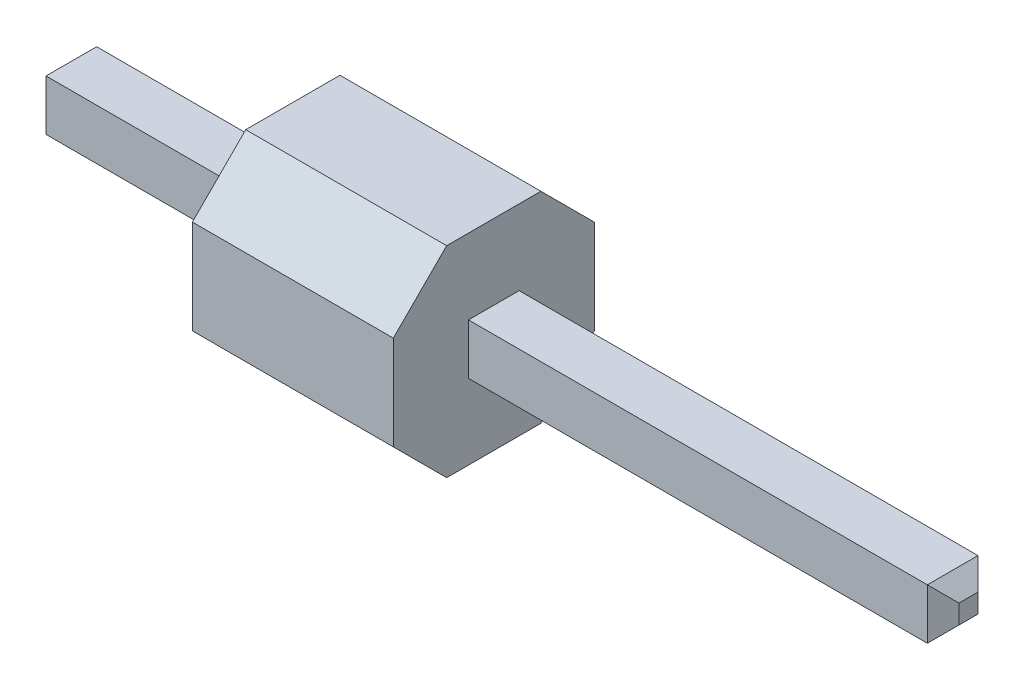
ISO-10303-21;
HEADER;
FILE_DESCRIPTION(('STEP AP214'),'2;1');
FILE_NAME('part.step','',(''),(''),'','','');
FILE_SCHEMA(('AUTOMOTIVE_DESIGN { 1 0 10303 214 1 1 1 1 }'));
ENDSEC;
DATA;
#1=APPLICATION_CONTEXT('core data for automotive mechanical design processes');
#2=APPLICATION_PROTOCOL_DEFINITION('international standard','automotive_design',2000,#1);
#3=PRODUCT_CONTEXT('',#1,'mechanical');
#4=PRODUCT('Part','Part','',(#3));
#5=PRODUCT_RELATED_PRODUCT_CATEGORY('part','',(#4));
#6=PRODUCT_DEFINITION_FORMATION('','',#4);
#7=PRODUCT_DEFINITION_CONTEXT('part definition',#1,'design');
#8=PRODUCT_DEFINITION('design','',#6,#7);
#9=PRODUCT_DEFINITION_SHAPE('','',#8);
#10=(LENGTH_UNIT() NAMED_UNIT(*) SI_UNIT(.MILLI.,.METRE.));
#11=(NAMED_UNIT(*) PLANE_ANGLE_UNIT() SI_UNIT($,.RADIAN.));
#12=(NAMED_UNIT(*) SI_UNIT($,.STERADIAN.) SOLID_ANGLE_UNIT());
#13=UNCERTAINTY_MEASURE_WITH_UNIT(LENGTH_MEASURE(1.E-05),#10,'distance_accuracy_value','');
#14=(GEOMETRIC_REPRESENTATION_CONTEXT(3) GLOBAL_UNCERTAINTY_ASSIGNED_CONTEXT((#13)) GLOBAL_UNIT_ASSIGNED_CONTEXT((#10,
#11,#12)) REPRESENTATION_CONTEXT('',''));
#15=CARTESIAN_POINT('',(0.,0.,0.));
#16=DIRECTION('',(0.,0.,1.));
#17=DIRECTION('',(1.,0.,0.));
#18=AXIS2_PLACEMENT_3D('',#15,#16,#17);
#19=CARTESIAN_POINT('',(-3.,-0.320000000000004,0.32));
#20=DIRECTION('',(0.,0.,1.));
#21=DIRECTION('',(1.,0.,0.));
#22=AXIS2_PLACEMENT_3D('',#19,#20,#21);
#23=PLANE('',#22);
#24=DIRECTION('',(1.,0.,0.));
#25=VECTOR('',#24,1.);
#26=CARTESIAN_POINT('',(-3.,0.319999999999996,0.32));
#27=LINE('',#26,#25);
#28=CARTESIAN_POINT('',(-2.8,0.319999999999996,0.32));
#29=VERTEX_POINT('',#28);
#30=CARTESIAN_POINT('',(8.34,0.319999999999996,0.32));
#31=VERTEX_POINT('',#30);
#32=EDGE_CURVE('E150',#29,#31,#27,.T.);
#33=ORIENTED_EDGE('',*,*,#32,.F.);
#34=DIRECTION('',(0.,-1.,0.));
#35=VECTOR('',#34,1.);
#36=CARTESIAN_POINT('',(-2.8,-0.320000000000004,0.32));
#37=LINE('',#36,#35);
#38=CARTESIAN_POINT('',(-2.8,-0.320000000000004,0.32));
#39=VERTEX_POINT('',#38);
#40=EDGE_CURVE('E170',#29,#39,#37,.T.);
#41=ORIENTED_EDGE('',*,*,#40,.T.);
#42=DIRECTION('',(1.,0.,0.));
#43=VECTOR('',#42,1.);
#44=CARTESIAN_POINT('',(-3.,-0.320000000000004,0.32));
#45=LINE('',#44,#43);
#46=CARTESIAN_POINT('',(8.34,-0.320000000000004,0.32));
#47=VERTEX_POINT('',#46);
#48=EDGE_CURVE('E141',#39,#47,#45,.T.);
#49=ORIENTED_EDGE('',*,*,#48,.T.);
#50=DIRECTION('',(0.,1.,0.));
#51=VECTOR('',#50,1.);
#52=CARTESIAN_POINT('',(8.34,0.319999999999996,0.32));
#53=LINE('',#52,#51);
#54=EDGE_CURVE('E168',#47,#31,#53,.T.);
#55=ORIENTED_EDGE('',*,*,#54,.T.);
#56=EDGE_LOOP('',(#33,#41,#49,#55));
#57=FACE_BOUND('',#56,.T.);
#58=ADVANCED_FACE('F45',(#57),#23,.T.);
#59=CARTESIAN_POINT('',(-3.,0.319999999999996,0.32));
#60=DIRECTION('',(0.,1.,0.));
#61=DIRECTION('',(0.,0.,1.));
#62=AXIS2_PLACEMENT_3D('',#59,#60,#61);
#63=PLANE('',#62);
#64=DIRECTION('',(1.,0.,0.));
#65=VECTOR('',#64,1.);
#66=CARTESIAN_POINT('',(-3.,0.319999999999996,-0.32));
#67=LINE('',#66,#65);
#68=CARTESIAN_POINT('',(-2.8,0.319999999999996,-0.32));
#69=VERTEX_POINT('',#68);
#70=CARTESIAN_POINT('',(8.34,0.319999999999996,-0.32));
#71=VERTEX_POINT('',#70);
#72=EDGE_CURVE('E148',#69,#71,#67,.T.);
#73=ORIENTED_EDGE('',*,*,#72,.F.);
#74=DIRECTION('',(0.,0.,1.));
#75=VECTOR('',#74,1.);
#76=CARTESIAN_POINT('',(-2.8,0.319999999999996,0.32));
#77=LINE('',#76,#75);
#78=EDGE_CURVE('E166',#69,#29,#77,.T.);
#79=ORIENTED_EDGE('',*,*,#78,.T.);
#80=ORIENTED_EDGE('',*,*,#32,.T.);
#81=DIRECTION('',(0.,0.,-1.));
#82=VECTOR('',#81,1.);
#83=CARTESIAN_POINT('',(8.34,0.319999999999996,-0.32));
#84=LINE('',#83,#82);
#85=EDGE_CURVE('E131',#31,#71,#84,.T.);
#86=ORIENTED_EDGE('',*,*,#85,.T.);
#87=EDGE_LOOP('',(#73,#79,#80,#86));
#88=FACE_BOUND('',#87,.T.);
#89=ADVANCED_FACE('F208',(#88),#63,.T.);
#90=CARTESIAN_POINT('',(-3.,-0.320000000000004,-0.32));
#91=DIRECTION('',(0.,0.,-1.));
#92=DIRECTION('',(-1.,0.,0.));
#93=AXIS2_PLACEMENT_3D('',#90,#91,#92);
#94=PLANE('',#93);
#95=DIRECTION('',(1.,0.,0.));
#96=VECTOR('',#95,1.);
#97=CARTESIAN_POINT('',(-3.,-0.320000000000004,-0.32));
#98=LINE('',#97,#96);
#99=CARTESIAN_POINT('',(-2.8,-0.320000000000004,-0.32));
#100=VERTEX_POINT('',#99);
#101=CARTESIAN_POINT('',(8.34,-0.320000000000004,-0.32));
#102=VERTEX_POINT('',#101);
#103=EDGE_CURVE('E138',#100,#102,#98,.T.);
#104=ORIENTED_EDGE('',*,*,#103,.F.);
#105=DIRECTION('',(0.,1.,0.));
#106=VECTOR('',#105,1.);
#107=CARTESIAN_POINT('',(-2.8,-0.320000000000004,-0.32));
#108=LINE('',#107,#106);
#109=EDGE_CURVE('E123',#100,#69,#108,.T.);
#110=ORIENTED_EDGE('',*,*,#109,.T.);
#111=ORIENTED_EDGE('',*,*,#72,.T.);
#112=DIRECTION('',(0.,-1.,0.));
#113=VECTOR('',#112,1.);
#114=CARTESIAN_POINT('',(8.34,-0.320000000000004,-0.32));
#115=LINE('',#114,#113);
#116=EDGE_CURVE('E132',#71,#102,#115,.T.);
#117=ORIENTED_EDGE('',*,*,#116,.T.);
#118=EDGE_LOOP('',(#104,#110,#111,#117));
#119=FACE_BOUND('',#118,.T.);
#120=ADVANCED_FACE('F146',(#119),#94,.T.);
#121=CARTESIAN_POINT('',(-3.,-0.320000000000004,0.32));
#122=DIRECTION('',(0.,-1.,0.));
#123=DIRECTION('',(0.,0.,-1.));
#124=AXIS2_PLACEMENT_3D('',#121,#122,#123);
#125=PLANE('',#124);
#126=ORIENTED_EDGE('',*,*,#48,.F.);
#127=DIRECTION('',(0.,0.,-1.));
#128=VECTOR('',#127,1.);
#129=CARTESIAN_POINT('',(-2.8,-0.320000000000004,0.32));
#130=LINE('',#129,#128);
#131=EDGE_CURVE('E115',#39,#100,#130,.T.);
#132=ORIENTED_EDGE('',*,*,#131,.T.);
#133=ORIENTED_EDGE('',*,*,#103,.T.);
#134=DIRECTION('',(0.,0.,1.));
#135=VECTOR('',#134,1.);
#136=CARTESIAN_POINT('',(8.34,-0.320000000000004,0.32));
#137=LINE('',#136,#135);
#138=EDGE_CURVE('E144',#102,#47,#137,.T.);
#139=ORIENTED_EDGE('',*,*,#138,.T.);
#140=EDGE_LOOP('',(#126,#132,#133,#139));
#141=FACE_BOUND('',#140,.T.);
#142=ADVANCED_FACE('F137',(#141),#125,.T.);
#143=CARTESIAN_POINT('',(-3.,0.,0.));
#144=DIRECTION('',(-1.,0.,0.));
#145=DIRECTION('',(0.,0.,1.));
#146=AXIS2_PLACEMENT_3D('',#143,#144,#145);
#147=PLANE('',#146);
#148=DIRECTION('',(0.,-1.,0.));
#149=VECTOR('',#148,1.);
#150=CARTESIAN_POINT('',(-3.,0.,-0.120000000000001));
#151=LINE('',#150,#149);
#152=CARTESIAN_POINT('',(-3.,0.119999999999997,-0.120000000000001));
#153=VERTEX_POINT('',#152);
#154=CARTESIAN_POINT('',(-3.,-0.120000000000006,-0.120000000000001));
#155=VERTEX_POINT('',#154);
#156=EDGE_CURVE('E160',#153,#155,#151,.T.);
#157=ORIENTED_EDGE('',*,*,#156,.T.);
#158=DIRECTION('',(0.,0.,1.));
#159=VECTOR('',#158,1.);
#160=CARTESIAN_POINT('',(-3.,-0.120000000000006,0.));
#161=LINE('',#160,#159);
#162=CARTESIAN_POINT('',(-3.,-0.120000000000006,0.120000000000001));
#163=VERTEX_POINT('',#162);
#164=EDGE_CURVE('E117',#155,#163,#161,.T.);
#165=ORIENTED_EDGE('',*,*,#164,.T.);
#166=DIRECTION('',(0.,1.,0.));
#167=VECTOR('',#166,1.);
#168=CARTESIAN_POINT('',(-3.,0.,0.120000000000001));
#169=LINE('',#168,#167);
#170=CARTESIAN_POINT('',(-3.,0.119999999999997,0.120000000000001));
#171=VERTEX_POINT('',#170);
#172=EDGE_CURVE('E143',#163,#171,#169,.T.);
#173=ORIENTED_EDGE('',*,*,#172,.T.);
#174=DIRECTION('',(0.,0.,-1.));
#175=VECTOR('',#174,1.);
#176=CARTESIAN_POINT('',(-3.,0.119999999999997,0.));
#177=LINE('',#176,#175);
#178=EDGE_CURVE('E158',#171,#153,#177,.T.);
#179=ORIENTED_EDGE('',*,*,#178,.T.);
#180=EDGE_LOOP('',(#157,#165,#173,#179));
#181=FACE_BOUND('',#180,.T.);
#182=ADVANCED_FACE('F203',(#181),#147,.T.);
#183=CARTESIAN_POINT('',(8.54,0.,0.));
#184=DIRECTION('',(-1.,0.,0.));
#185=DIRECTION('',(0.,0.,1.));
#186=AXIS2_PLACEMENT_3D('',#183,#184,#185);
#187=PLANE('',#186);
#188=DIRECTION('',(0.,1.,0.));
#189=VECTOR('',#188,1.);
#190=CARTESIAN_POINT('',(8.54,0.319999999999996,-0.120000000000001));
#191=LINE('',#190,#189);
#192=CARTESIAN_POINT('',(8.54,-0.120000000000006,-0.120000000000001));
#193=VERTEX_POINT('',#192);
#194=CARTESIAN_POINT('',(8.54,0.119999999999997,-0.120000000000001));
#195=VERTEX_POINT('',#194);
#196=EDGE_CURVE('E54',#193,#195,#191,.T.);
#197=ORIENTED_EDGE('',*,*,#196,.T.);
#198=DIRECTION('',(0.,0.,1.));
#199=VECTOR('',#198,1.);
#200=CARTESIAN_POINT('',(8.54,0.119999999999997,0.32));
#201=LINE('',#200,#199);
#202=CARTESIAN_POINT('',(8.54,0.119999999999997,0.120000000000001));
#203=VERTEX_POINT('',#202);
#204=EDGE_CURVE('E12',#195,#203,#201,.T.);
#205=ORIENTED_EDGE('',*,*,#204,.T.);
#206=DIRECTION('',(0.,-1.,0.));
#207=VECTOR('',#206,1.);
#208=CARTESIAN_POINT('',(8.54,-0.320000000000004,0.120000000000001));
#209=LINE('',#208,#207);
#210=CARTESIAN_POINT('',(8.54,-0.120000000000006,0.120000000000001));
#211=VERTEX_POINT('',#210);
#212=EDGE_CURVE('E172',#203,#211,#209,.T.);
#213=ORIENTED_EDGE('',*,*,#212,.T.);
#214=DIRECTION('',(0.,0.,-1.));
#215=VECTOR('',#214,1.);
#216=CARTESIAN_POINT('',(8.54,-0.120000000000006,-0.32));
#217=LINE('',#216,#215);
#218=EDGE_CURVE('E65',#211,#193,#217,.T.);
#219=ORIENTED_EDGE('',*,*,#218,.T.);
#220=EDGE_LOOP('',(#197,#205,#213,#219));
#221=FACE_BOUND('',#220,.T.);
#222=ADVANCED_FACE('F215',(#221),#187,.F.);
#223=CARTESIAN_POINT('',(-2.8,0.319999999999996,0.32));
#224=DIRECTION('',(0.707106781186551,-0.707106781186544,0.));
#225=DIRECTION('',(0.,0.,1.));
#226=AXIS2_PLACEMENT_3D('',#223,#224,#225);
#227=PLANE('',#226);
#228=DIRECTION('',(-0.577350269189622,-0.577350269189627,0.577350269189627));
#229=VECTOR('',#228,1.);
#230=CARTESIAN_POINT('',(-3.01333333333334,0.106666666666661,-0.106666666666665));
#231=LINE('',#230,#229);
#232=EDGE_CURVE('E126',#153,#69,#231,.F.);
#233=ORIENTED_EDGE('',*,*,#232,.F.);
#234=ORIENTED_EDGE('',*,*,#178,.F.);
#235=DIRECTION('',(-0.577350269189622,-0.577350269189627,-0.577350269189627));
#236=VECTOR('',#235,1.);
#237=CARTESIAN_POINT('',(-3.01333333333334,0.106666666666661,0.106666666666665));
#238=LINE('',#237,#236);
#239=EDGE_CURVE('E152',#29,#171,#238,.T.);
#240=ORIENTED_EDGE('',*,*,#239,.F.);
#241=ORIENTED_EDGE('',*,*,#78,.F.);
#242=EDGE_LOOP('',(#233,#234,#240,#241));
#243=FACE_BOUND('',#242,.T.);
#244=ADVANCED_FACE('F206',(#243),#227,.F.);
#245=CARTESIAN_POINT('',(-2.8,-0.320000000000004,0.32));
#246=DIRECTION('',(0.707106781186551,0.,-0.707106781186544));
#247=DIRECTION('',(0.,-1.,0.));
#248=AXIS2_PLACEMENT_3D('',#245,#246,#247);
#249=PLANE('',#248);
#250=ORIENTED_EDGE('',*,*,#239,.T.);
#251=ORIENTED_EDGE('',*,*,#172,.F.);
#252=DIRECTION('',(0.577350269189622,-0.577350269189627,0.577350269189627));
#253=VECTOR('',#252,1.);
#254=CARTESIAN_POINT('',(-2.8,-0.320000000000004,0.32));
#255=LINE('',#254,#253);
#256=EDGE_CURVE('E120',#39,#163,#255,.F.);
#257=ORIENTED_EDGE('',*,*,#256,.F.);
#258=ORIENTED_EDGE('',*,*,#40,.F.);
#259=EDGE_LOOP('',(#250,#251,#257,#258));
#260=FACE_BOUND('',#259,.T.);
#261=ADVANCED_FACE('F199',(#260),#249,.F.);
#262=CARTESIAN_POINT('',(-2.8,-0.320000000000004,-0.32));
#263=DIRECTION('',(0.707106781186551,0.,0.707106781186544));
#264=DIRECTION('',(0.,1.,0.));
#265=AXIS2_PLACEMENT_3D('',#262,#263,#264);
#266=PLANE('',#265);
#267=ORIENTED_EDGE('',*,*,#232,.T.);
#268=ORIENTED_EDGE('',*,*,#109,.F.);
#269=DIRECTION('',(-0.577350269189622,0.577350269189627,0.577350269189627));
#270=VECTOR('',#269,1.);
#271=CARTESIAN_POINT('',(-2.8,-0.320000000000004,-0.32));
#272=LINE('',#271,#270);
#273=EDGE_CURVE('E111',#155,#100,#272,.F.);
#274=ORIENTED_EDGE('',*,*,#273,.F.);
#275=ORIENTED_EDGE('',*,*,#156,.F.);
#276=EDGE_LOOP('',(#267,#268,#274,#275));
#277=FACE_BOUND('',#276,.T.);
#278=ADVANCED_FACE('F124',(#277),#266,.F.);
#279=CARTESIAN_POINT('',(-2.8,-0.320000000000004,0.32));
#280=DIRECTION('',(0.707106781186551,0.707106781186544,0.));
#281=DIRECTION('',(0.,0.,-1.));
#282=AXIS2_PLACEMENT_3D('',#279,#280,#281);
#283=PLANE('',#282);
#284=ORIENTED_EDGE('',*,*,#256,.T.);
#285=ORIENTED_EDGE('',*,*,#164,.F.);
#286=ORIENTED_EDGE('',*,*,#273,.T.);
#287=ORIENTED_EDGE('',*,*,#131,.F.);
#288=EDGE_LOOP('',(#284,#285,#286,#287));
#289=FACE_BOUND('',#288,.T.);
#290=ADVANCED_FACE('F113',(#289),#283,.F.);
#291=CARTESIAN_POINT('',(8.54,-0.120000000000006,0.));
#292=DIRECTION('',(0.707106781186548,-0.707106781186548,0.));
#293=DIRECTION('',(0.,0.,1.));
#294=AXIS2_PLACEMENT_3D('',#291,#292,#293);
#295=PLANE('',#294);
#296=DIRECTION('',(0.577350269189626,0.577350269189626,-0.577350269189626));
#297=VECTOR('',#296,1.);
#298=CARTESIAN_POINT('',(8.58,-0.0800000000000037,0.0799999999999993));
#299=LINE('',#298,#297);
#300=EDGE_CURVE('E183',#47,#211,#299,.T.);
#301=ORIENTED_EDGE('',*,*,#300,.F.);
#302=ORIENTED_EDGE('',*,*,#138,.F.);
#303=DIRECTION('',(0.577350269189626,0.577350269189626,0.577350269189626));
#304=VECTOR('',#303,1.);
#305=CARTESIAN_POINT('',(8.58,-0.0800000000000052,-0.0800000000000008));
#306=LINE('',#305,#304);
#307=EDGE_CURVE('E49',#193,#102,#306,.F.);
#308=ORIENTED_EDGE('',*,*,#307,.F.);
#309=ORIENTED_EDGE('',*,*,#218,.F.);
#310=EDGE_LOOP('',(#301,#302,#308,#309));
#311=FACE_BOUND('',#310,.T.);
#312=ADVANCED_FACE('F47',(#311),#295,.T.);
#313=CARTESIAN_POINT('',(8.54,0.,-0.120000000000001));
#314=DIRECTION('',(0.707106781186548,0.,-0.707106781186548));
#315=DIRECTION('',(0.,-1.,0.));
#316=AXIS2_PLACEMENT_3D('',#313,#314,#315);
#317=PLANE('',#316);
#318=ORIENTED_EDGE('',*,*,#307,.T.);
#319=ORIENTED_EDGE('',*,*,#116,.F.);
#320=DIRECTION('',(0.577350269189626,-0.577350269189626,0.577350269189626));
#321=VECTOR('',#320,1.);
#322=CARTESIAN_POINT('',(8.58,0.0799999999999979,-0.0800000000000023));
#323=LINE('',#322,#321);
#324=EDGE_CURVE('E182',#195,#71,#323,.F.);
#325=ORIENTED_EDGE('',*,*,#324,.F.);
#326=ORIENTED_EDGE('',*,*,#196,.F.);
#327=EDGE_LOOP('',(#318,#319,#325,#326));
#328=FACE_BOUND('',#327,.T.);
#329=ADVANCED_FACE('F191',(#328),#317,.T.);
#330=CARTESIAN_POINT('',(8.54,0.,0.120000000000001));
#331=DIRECTION('',(0.707106781186548,0.,0.707106781186548));
#332=DIRECTION('',(0.,1.,0.));
#333=AXIS2_PLACEMENT_3D('',#330,#331,#332);
#334=PLANE('',#333);
#335=ORIENTED_EDGE('',*,*,#300,.T.);
#336=ORIENTED_EDGE('',*,*,#212,.F.);
#337=DIRECTION('',(-0.577350269189626,0.577350269189626,0.577350269189626));
#338=VECTOR('',#337,1.);
#339=CARTESIAN_POINT('',(8.58,0.0799999999999979,0.0800000000000022));
#340=LINE('',#339,#338);
#341=EDGE_CURVE('E180',#31,#203,#340,.F.);
#342=ORIENTED_EDGE('',*,*,#341,.F.);
#343=ORIENTED_EDGE('',*,*,#54,.F.);
#344=EDGE_LOOP('',(#335,#336,#342,#343));
#345=FACE_BOUND('',#344,.T.);
#346=ADVANCED_FACE('F214',(#345),#334,.T.);
#347=CARTESIAN_POINT('',(8.54,0.119999999999997,0.));
#348=DIRECTION('',(0.707106781186548,0.707106781186548,0.));
#349=DIRECTION('',(0.,0.,-1.));
#350=AXIS2_PLACEMENT_3D('',#347,#348,#349);
#351=PLANE('',#350);
#352=ORIENTED_EDGE('',*,*,#324,.T.);
#353=ORIENTED_EDGE('',*,*,#85,.F.);
#354=ORIENTED_EDGE('',*,*,#341,.T.);
#355=ORIENTED_EDGE('',*,*,#204,.F.);
#356=EDGE_LOOP('',(#352,#353,#354,#355));
#357=FACE_BOUND('',#356,.T.);
#358=ADVANCED_FACE('F212',(#357),#351,.T.);
#359=CLOSED_SHELL('',(#58,#89,#120,#142,#182,#222,#244,#261,#278,#290,#312,#329,#346,#358));
#360=MANIFOLD_SOLID_BREP('B2',#359);
#361=CARTESIAN_POINT('',(2.54,0.,-1.27));
#362=DIRECTION('',(0.,0.,-1.));
#363=DIRECTION('',(-1.,0.,0.));
#364=AXIS2_PLACEMENT_3D('',#361,#362,#363);
#365=PLANE('',#364);
#366=DIRECTION('',(0.,-1.,0.));
#367=VECTOR('',#366,1.);
#368=CARTESIAN_POINT('',(0.,0.,-1.27));
#369=LINE('',#368,#367);
#370=CARTESIAN_POINT('',(0.,0.595482682999996,-1.27));
#371=VERTEX_POINT('',#370);
#372=CARTESIAN_POINT('',(0.,-0.595482683000005,-1.27));
#373=VERTEX_POINT('',#372);
#374=EDGE_CURVE('E464',#371,#373,#369,.T.);
#375=ORIENTED_EDGE('',*,*,#374,.F.);
#376=DIRECTION('',(-1.,0.,0.));
#377=VECTOR('',#376,1.);
#378=CARTESIAN_POINT('',(2.54,0.595482682999996,-1.27));
#379=LINE('',#378,#377);
#380=CARTESIAN_POINT('',(2.54,0.595482682999996,-1.27));
#381=VERTEX_POINT('',#380);
#382=EDGE_CURVE('E43',#381,#371,#379,.T.);
#383=ORIENTED_EDGE('',*,*,#382,.F.);
#384=DIRECTION('',(0.,-1.,0.));
#385=VECTOR('',#384,1.);
#386=CARTESIAN_POINT('',(2.54,0.,-1.27));
#387=LINE('',#386,#385);
#388=CARTESIAN_POINT('',(2.54,-0.595482683000005,-1.27));
#389=VERTEX_POINT('',#388);
#390=EDGE_CURVE('E521',#381,#389,#387,.T.);
#391=ORIENTED_EDGE('',*,*,#390,.T.);
#392=DIRECTION('',(-1.,0.,0.));
#393=VECTOR('',#392,1.);
#394=CARTESIAN_POINT('',(2.54,-0.595482683000005,-1.27));
#395=LINE('',#394,#393);
#396=EDGE_CURVE('E348',#389,#373,#395,.T.);
#397=ORIENTED_EDGE('',*,*,#396,.T.);
#398=EDGE_LOOP('',(#375,#383,#391,#397));
#399=FACE_BOUND('',#398,.T.);
#400=ADVANCED_FACE('F329',(#399),#365,.T.);
#401=CARTESIAN_POINT('',(2.54,0.932741341499998,-0.932741341499998));
#402=DIRECTION('',(0.,-0.707106781186548,0.707106781186547));
#403=DIRECTION('',(0.,-0.707106781186547,-0.707106781186548));
#404=AXIS2_PLACEMENT_3D('',#401,#402,#403);
#405=PLANE('',#404);
#406=DIRECTION('',(0.,0.707106781186547,0.707106781186548));
#407=VECTOR('',#406,1.);
#408=CARTESIAN_POINT('',(0.,0.932741341499998,-0.932741341499998));
#409=LINE('',#408,#407);
#410=CARTESIAN_POINT('',(0.,1.27,-0.595482683));
#411=VERTEX_POINT('',#410);
#412=EDGE_CURVE('E466',#371,#411,#409,.T.);
#413=ORIENTED_EDGE('',*,*,#412,.T.);
#414=DIRECTION('',(-1.,0.,0.));
#415=VECTOR('',#414,1.);
#416=CARTESIAN_POINT('',(2.54,1.27,-0.595482683));
#417=LINE('',#416,#415);
#418=CARTESIAN_POINT('',(2.54,1.27,-0.595482683));
#419=VERTEX_POINT('',#418);
#420=EDGE_CURVE('E339',#419,#411,#417,.T.);
#421=ORIENTED_EDGE('',*,*,#420,.F.);
#422=DIRECTION('',(0.,0.707106781186547,0.707106781186548));
#423=VECTOR('',#422,1.);
#424=CARTESIAN_POINT('',(2.54,0.932741341499998,-0.932741341499998));
#425=LINE('',#424,#423);
#426=EDGE_CURVE('E524',#381,#419,#425,.T.);
#427=ORIENTED_EDGE('',*,*,#426,.F.);
#428=ORIENTED_EDGE('',*,*,#382,.T.);
#429=EDGE_LOOP('',(#413,#421,#427,#428));
#430=FACE_BOUND('',#429,.T.);
#431=ADVANCED_FACE('F554',(#430),#405,.F.);
#432=CARTESIAN_POINT('',(2.54,1.27,0.));
#433=DIRECTION('',(0.,-1.,0.));
#434=DIRECTION('',(0.,0.,-1.));
#435=AXIS2_PLACEMENT_3D('',#432,#433,#434);
#436=PLANE('',#435);
#437=DIRECTION('',(0.,0.,1.));
#438=VECTOR('',#437,1.);
#439=CARTESIAN_POINT('',(0.,1.27,0.));
#440=LINE('',#439,#438);
#441=CARTESIAN_POINT('',(0.,1.27,0.595482683));
#442=VERTEX_POINT('',#441);
#443=EDGE_CURVE('E469',#411,#442,#440,.T.);
#444=ORIENTED_EDGE('',*,*,#443,.T.);
#445=DIRECTION('',(-1.,0.,0.));
#446=VECTOR('',#445,1.);
#447=CARTESIAN_POINT('',(2.54,1.27,0.595482683));
#448=LINE('',#447,#446);
#449=CARTESIAN_POINT('',(2.54,1.27,0.595482683));
#450=VERTEX_POINT('',#449);
#451=EDGE_CURVE('E491',#450,#442,#448,.T.);
#452=ORIENTED_EDGE('',*,*,#451,.F.);
#453=DIRECTION('',(0.,0.,1.));
#454=VECTOR('',#453,1.);
#455=CARTESIAN_POINT('',(2.54,1.27,0.));
#456=LINE('',#455,#454);
#457=EDGE_CURVE('E531',#419,#450,#456,.T.);
#458=ORIENTED_EDGE('',*,*,#457,.F.);
#459=ORIENTED_EDGE('',*,*,#420,.T.);
#460=EDGE_LOOP('',(#444,#452,#458,#459));
#461=FACE_BOUND('',#460,.T.);
#462=ADVANCED_FACE('F559',(#461),#436,.F.);
#463=CARTESIAN_POINT('',(2.54,0.932741341499998,0.932741341499998));
#464=DIRECTION('',(0.,-0.707106781186548,-0.707106781186548));
#465=DIRECTION('',(0.,0.707106781186548,-0.707106781186548));
#466=AXIS2_PLACEMENT_3D('',#463,#464,#465);
#467=PLANE('',#466);
#468=DIRECTION('',(0.,-0.707106781186548,0.707106781186548));
#469=VECTOR('',#468,1.);
#470=CARTESIAN_POINT('',(0.,0.932741341499998,0.932741341499998));
#471=LINE('',#470,#469);
#472=CARTESIAN_POINT('',(0.,0.595482682999995,1.27));
#473=VERTEX_POINT('',#472);
#474=EDGE_CURVE('E472',#442,#473,#471,.T.);
#475=ORIENTED_EDGE('',*,*,#474,.T.);
#476=DIRECTION('',(-1.,0.,0.));
#477=VECTOR('',#476,1.);
#478=CARTESIAN_POINT('',(2.54,0.595482682999995,1.27));
#479=LINE('',#478,#477);
#480=CARTESIAN_POINT('',(2.54,0.595482682999995,1.27));
#481=VERTEX_POINT('',#480);
#482=EDGE_CURVE('E488',#481,#473,#479,.T.);
#483=ORIENTED_EDGE('',*,*,#482,.F.);
#484=DIRECTION('',(0.,-0.707106781186548,0.707106781186548));
#485=VECTOR('',#484,1.);
#486=CARTESIAN_POINT('',(2.54,0.932741341499998,0.932741341499998));
#487=LINE('',#486,#485);
#488=EDGE_CURVE('E534',#450,#481,#487,.T.);
#489=ORIENTED_EDGE('',*,*,#488,.F.);
#490=ORIENTED_EDGE('',*,*,#451,.T.);
#491=EDGE_LOOP('',(#475,#483,#489,#490));
#492=FACE_BOUND('',#491,.T.);
#493=ADVANCED_FACE('F538',(#492),#467,.F.);
#494=CARTESIAN_POINT('',(2.54,0.,1.27));
#495=DIRECTION('',(0.,0.,-1.));
#496=DIRECTION('',(-1.,0.,0.));
#497=AXIS2_PLACEMENT_3D('',#494,#495,#496);
#498=PLANE('',#497);
#499=DIRECTION('',(0.,-1.,0.));
#500=VECTOR('',#499,1.);
#501=CARTESIAN_POINT('',(0.,0.,1.27));
#502=LINE('',#501,#500);
#503=CARTESIAN_POINT('',(0.,-0.595482683000005,1.27));
#504=VERTEX_POINT('',#503);
#505=EDGE_CURVE('E475',#473,#504,#502,.T.);
#506=ORIENTED_EDGE('',*,*,#505,.T.);
#507=DIRECTION('',(-1.,0.,0.));
#508=VECTOR('',#507,1.);
#509=CARTESIAN_POINT('',(2.54,-0.595482683000005,1.27));
#510=LINE('',#509,#508);
#511=CARTESIAN_POINT('',(2.54,-0.595482683000005,1.27));
#512=VERTEX_POINT('',#511);
#513=EDGE_CURVE('E434',#512,#504,#510,.T.);
#514=ORIENTED_EDGE('',*,*,#513,.F.);
#515=DIRECTION('',(0.,-1.,0.));
#516=VECTOR('',#515,1.);
#517=CARTESIAN_POINT('',(2.54,0.,1.27));
#518=LINE('',#517,#516);
#519=EDGE_CURVE('E443',#481,#512,#518,.T.);
#520=ORIENTED_EDGE('',*,*,#519,.F.);
#521=ORIENTED_EDGE('',*,*,#482,.T.);
#522=EDGE_LOOP('',(#506,#514,#520,#521));
#523=FACE_BOUND('',#522,.T.);
#524=ADVANCED_FACE('F540',(#523),#498,.F.);
#525=CARTESIAN_POINT('',(2.54,-0.932741341500003,0.932741341500002));
#526=DIRECTION('',(0.,-0.707106781186548,0.707106781186547));
#527=DIRECTION('',(0.,-0.707106781186547,-0.707106781186548));
#528=AXIS2_PLACEMENT_3D('',#525,#526,#527);
#529=PLANE('',#528);
#530=DIRECTION('',(0.,0.707106781186547,0.707106781186548));
#531=VECTOR('',#530,1.);
#532=CARTESIAN_POINT('',(0.,-0.932741341500003,0.932741341500002));
#533=LINE('',#532,#531);
#534=CARTESIAN_POINT('',(0.,-1.27,0.595482683));
#535=VERTEX_POINT('',#534);
#536=EDGE_CURVE('E430',#535,#504,#533,.T.);
#537=ORIENTED_EDGE('',*,*,#536,.F.);
#538=DIRECTION('',(-1.,0.,0.));
#539=VECTOR('',#538,1.);
#540=CARTESIAN_POINT('',(2.54,-1.27,0.595482683));
#541=LINE('',#540,#539);
#542=CARTESIAN_POINT('',(2.54,-1.27,0.595482683));
#543=VERTEX_POINT('',#542);
#544=EDGE_CURVE('E425',#543,#535,#541,.T.);
#545=ORIENTED_EDGE('',*,*,#544,.F.);
#546=DIRECTION('',(0.,0.707106781186547,0.707106781186548));
#547=VECTOR('',#546,1.);
#548=CARTESIAN_POINT('',(2.54,-0.932741341500003,0.932741341500002));
#549=LINE('',#548,#547);
#550=EDGE_CURVE('E428',#543,#512,#549,.T.);
#551=ORIENTED_EDGE('',*,*,#550,.T.);
#552=ORIENTED_EDGE('',*,*,#513,.T.);
#553=EDGE_LOOP('',(#537,#545,#551,#552));
#554=FACE_BOUND('',#553,.T.);
#555=ADVANCED_FACE('F427',(#554),#529,.T.);
#556=CARTESIAN_POINT('',(2.54,-1.27,0.));
#557=DIRECTION('',(0.,-1.,0.));
#558=DIRECTION('',(0.,0.,-1.));
#559=AXIS2_PLACEMENT_3D('',#556,#557,#558);
#560=PLANE('',#559);
#561=DIRECTION('',(0.,0.,1.));
#562=VECTOR('',#561,1.);
#563=CARTESIAN_POINT('',(0.,-1.27,0.));
#564=LINE('',#563,#562);
#565=CARTESIAN_POINT('',(0.,-1.27,-0.595482683));
#566=VERTEX_POINT('',#565);
#567=EDGE_CURVE('E479',#566,#535,#564,.T.);
#568=ORIENTED_EDGE('',*,*,#567,.F.);
#569=DIRECTION('',(-1.,0.,0.));
#570=VECTOR('',#569,1.);
#571=CARTESIAN_POINT('',(2.54,-1.27,-0.595482683));
#572=LINE('',#571,#570);
#573=CARTESIAN_POINT('',(2.54,-1.27,-0.595482683));
#574=VERTEX_POINT('',#573);
#575=EDGE_CURVE('E385',#574,#566,#572,.T.);
#576=ORIENTED_EDGE('',*,*,#575,.F.);
#577=DIRECTION('',(0.,0.,1.));
#578=VECTOR('',#577,1.);
#579=CARTESIAN_POINT('',(2.54,-1.27,0.));
#580=LINE('',#579,#578);
#581=EDGE_CURVE('E441',#574,#543,#580,.T.);
#582=ORIENTED_EDGE('',*,*,#581,.T.);
#583=ORIENTED_EDGE('',*,*,#544,.T.);
#584=EDGE_LOOP('',(#568,#576,#582,#583));
#585=FACE_BOUND('',#584,.T.);
#586=ADVANCED_FACE('F446',(#585),#560,.T.);
#587=CARTESIAN_POINT('',(2.54,0.,0.32));
#588=DIRECTION('',(0.,0.,-1.));
#589=DIRECTION('',(0.,1.,0.));
#590=AXIS2_PLACEMENT_3D('',#587,#588,#589);
#591=PLANE('',#590);
#592=DIRECTION('',(0.,-1.,0.));
#593=VECTOR('',#592,1.);
#594=CARTESIAN_POINT('',(0.,0.,0.32));
#595=LINE('',#594,#593);
#596=CARTESIAN_POINT('',(0.,0.319999999999996,0.32));
#597=VERTEX_POINT('',#596);
#598=CARTESIAN_POINT('',(0.,-0.320000000000004,0.32));
#599=VERTEX_POINT('',#598);
#600=EDGE_CURVE('E453',#597,#599,#595,.T.);
#601=ORIENTED_EDGE('',*,*,#600,.F.);
#602=DIRECTION('',(-1.,0.,0.));
#603=VECTOR('',#602,1.);
#604=CARTESIAN_POINT('',(2.54,0.319999999999996,0.32));
#605=LINE('',#604,#603);
#606=CARTESIAN_POINT('',(2.54,0.319999999999996,0.32));
#607=VERTEX_POINT('',#606);
#608=EDGE_CURVE('E333',#607,#597,#605,.T.);
#609=ORIENTED_EDGE('',*,*,#608,.F.);
#610=DIRECTION('',(0.,-1.,0.));
#611=VECTOR('',#610,1.);
#612=CARTESIAN_POINT('',(2.54,0.,0.32));
#613=LINE('',#612,#611);
#614=CARTESIAN_POINT('',(2.54,-0.320000000000004,0.32));
#615=VERTEX_POINT('',#614);
#616=EDGE_CURVE('E484',#607,#615,#613,.T.);
#617=ORIENTED_EDGE('',*,*,#616,.T.);
#618=DIRECTION('',(-1.,0.,0.));
#619=VECTOR('',#618,1.);
#620=CARTESIAN_POINT('',(2.54,-0.320000000000004,0.32));
#621=LINE('',#620,#619);
#622=EDGE_CURVE('E449',#615,#599,#621,.T.);
#623=ORIENTED_EDGE('',*,*,#622,.T.);
#624=EDGE_LOOP('',(#601,#609,#617,#623));
#625=FACE_BOUND('',#624,.T.);
#626=ADVANCED_FACE('F331',(#625),#591,.T.);
#627=CARTESIAN_POINT('',(2.54,0.319999999999996,0.));
#628=DIRECTION('',(0.,-1.,0.));
#629=DIRECTION('',(0.,0.,-1.));
#630=AXIS2_PLACEMENT_3D('',#627,#628,#629);
#631=PLANE('',#630);
#632=DIRECTION('',(0.,0.,1.));
#633=VECTOR('',#632,1.);
#634=CARTESIAN_POINT('',(0.,0.319999999999996,0.));
#635=LINE('',#634,#633);
#636=CARTESIAN_POINT('',(0.,0.319999999999996,-0.32));
#637=VERTEX_POINT('',#636);
#638=EDGE_CURVE('E456',#637,#597,#635,.T.);
#639=ORIENTED_EDGE('',*,*,#638,.F.);
#640=DIRECTION('',(-1.,0.,0.));
#641=VECTOR('',#640,1.);
#642=CARTESIAN_POINT('',(2.54,0.319999999999996,-0.32));
#643=LINE('',#642,#641);
#644=CARTESIAN_POINT('',(2.54,0.319999999999996,-0.32));
#645=VERTEX_POINT('',#644);
#646=EDGE_CURVE('E499',#645,#637,#643,.T.);
#647=ORIENTED_EDGE('',*,*,#646,.F.);
#648=DIRECTION('',(0.,0.,1.));
#649=VECTOR('',#648,1.);
#650=CARTESIAN_POINT('',(2.54,0.319999999999996,0.));
#651=LINE('',#650,#649);
#652=EDGE_CURVE('E508',#645,#607,#651,.T.);
#653=ORIENTED_EDGE('',*,*,#652,.T.);
#654=ORIENTED_EDGE('',*,*,#608,.T.);
#655=EDGE_LOOP('',(#639,#647,#653,#654));
#656=FACE_BOUND('',#655,.T.);
#657=ADVANCED_FACE('F506',(#656),#631,.T.);
#658=CARTESIAN_POINT('',(2.54,0.,-0.32));
#659=DIRECTION('',(0.,0.,-1.));
#660=DIRECTION('',(0.,1.,0.));
#661=AXIS2_PLACEMENT_3D('',#658,#659,#660);
#662=PLANE('',#661);
#663=DIRECTION('',(0.,-1.,0.));
#664=VECTOR('',#663,1.);
#665=CARTESIAN_POINT('',(0.,0.,-0.32));
#666=LINE('',#665,#664);
#667=CARTESIAN_POINT('',(0.,-0.320000000000004,-0.32));
#668=VERTEX_POINT('',#667);
#669=EDGE_CURVE('E459',#637,#668,#666,.T.);
#670=ORIENTED_EDGE('',*,*,#669,.T.);
#671=DIRECTION('',(-1.,0.,0.));
#672=VECTOR('',#671,1.);
#673=CARTESIAN_POINT('',(2.54,-0.320000000000004,-0.32));
#674=LINE('',#673,#672);
#675=CARTESIAN_POINT('',(2.54,-0.320000000000004,-0.32));
#676=VERTEX_POINT('',#675);
#677=EDGE_CURVE('E497',#676,#668,#674,.T.);
#678=ORIENTED_EDGE('',*,*,#677,.F.);
#679=DIRECTION('',(0.,-1.,0.));
#680=VECTOR('',#679,1.);
#681=CARTESIAN_POINT('',(2.54,0.,-0.32));
#682=LINE('',#681,#680);
#683=EDGE_CURVE('E522',#645,#676,#682,.T.);
#684=ORIENTED_EDGE('',*,*,#683,.F.);
#685=ORIENTED_EDGE('',*,*,#646,.T.);
#686=EDGE_LOOP('',(#670,#678,#684,#685));
#687=FACE_BOUND('',#686,.T.);
#688=ADVANCED_FACE('F515',(#687),#662,.F.);
#689=CARTESIAN_POINT('',(2.54,-0.320000000000004,0.));
#690=DIRECTION('',(0.,-1.,0.));
#691=DIRECTION('',(0.,0.,-1.));
#692=AXIS2_PLACEMENT_3D('',#689,#690,#691);
#693=PLANE('',#692);
#694=DIRECTION('',(0.,0.,1.));
#695=VECTOR('',#694,1.);
#696=CARTESIAN_POINT('',(0.,-0.320000000000004,0.));
#697=LINE('',#696,#695);
#698=EDGE_CURVE('E461',#668,#599,#697,.T.);
#699=ORIENTED_EDGE('',*,*,#698,.T.);
#700=ORIENTED_EDGE('',*,*,#622,.F.);
#701=DIRECTION('',(0.,0.,1.));
#702=VECTOR('',#701,1.);
#703=CARTESIAN_POINT('',(2.54,-0.320000000000004,0.));
#704=LINE('',#703,#702);
#705=EDGE_CURVE('E519',#676,#615,#704,.T.);
#706=ORIENTED_EDGE('',*,*,#705,.F.);
#707=ORIENTED_EDGE('',*,*,#677,.T.);
#708=EDGE_LOOP('',(#699,#700,#706,#707));
#709=FACE_BOUND('',#708,.T.);
#710=ADVANCED_FACE('F518',(#709),#693,.F.);
#711=CARTESIAN_POINT('',(2.54,-0.932741341500002,-0.932741341500002));
#712=DIRECTION('',(0.,-0.707106781186548,-0.707106781186548));
#713=DIRECTION('',(0.,0.707106781186548,-0.707106781186548));
#714=AXIS2_PLACEMENT_3D('',#711,#712,#713);
#715=PLANE('',#714);
#716=DIRECTION('',(0.,-0.707106781186548,0.707106781186548));
#717=VECTOR('',#716,1.);
#718=CARTESIAN_POINT('',(0.,-0.932741341500002,-0.932741341500002));
#719=LINE('',#718,#717);
#720=EDGE_CURVE('E481',#373,#566,#719,.T.);
#721=ORIENTED_EDGE('',*,*,#720,.F.);
#722=ORIENTED_EDGE('',*,*,#396,.F.);
#723=DIRECTION('',(0.,-0.707106781186548,0.707106781186548));
#724=VECTOR('',#723,1.);
#725=CARTESIAN_POINT('',(2.54,-0.932741341500002,-0.932741341500002));
#726=LINE('',#725,#724);
#727=EDGE_CURVE('E447',#389,#574,#726,.T.);
#728=ORIENTED_EDGE('',*,*,#727,.T.);
#729=ORIENTED_EDGE('',*,*,#575,.T.);
#730=EDGE_LOOP('',(#721,#722,#728,#729));
#731=FACE_BOUND('',#730,.T.);
#732=ADVANCED_FACE('F542',(#731),#715,.T.);
#733=CARTESIAN_POINT('',(2.54,0.,0.));
#734=DIRECTION('',(1.,0.,0.));
#735=DIRECTION('',(0.,0.,-1.));
#736=AXIS2_PLACEMENT_3D('',#733,#734,#735);
#737=PLANE('',#736);
#738=ORIENTED_EDGE('',*,*,#616,.F.);
#739=ORIENTED_EDGE('',*,*,#652,.F.);
#740=ORIENTED_EDGE('',*,*,#683,.T.);
#741=ORIENTED_EDGE('',*,*,#705,.T.);
#742=EDGE_LOOP('',(#738,#739,#740,#741));
#743=FACE_BOUND('',#742,.T.);
#744=ORIENTED_EDGE('',*,*,#390,.F.);
#745=ORIENTED_EDGE('',*,*,#426,.T.);
#746=ORIENTED_EDGE('',*,*,#457,.T.);
#747=ORIENTED_EDGE('',*,*,#488,.T.);
#748=ORIENTED_EDGE('',*,*,#519,.T.);
#749=ORIENTED_EDGE('',*,*,#550,.F.);
#750=ORIENTED_EDGE('',*,*,#581,.F.);
#751=ORIENTED_EDGE('',*,*,#727,.F.);
#752=EDGE_LOOP('',(#744,#745,#746,#747,#748,#749,#750,#751));
#753=FACE_BOUND('',#752,.T.);
#754=ADVANCED_FACE('F439',(#743,#753),#737,.T.);
#755=CARTESIAN_POINT('',(0.,0.,0.));
#756=DIRECTION('',(1.,0.,0.));
#757=DIRECTION('',(0.,0.,-1.));
#758=AXIS2_PLACEMENT_3D('',#755,#756,#757);
#759=PLANE('',#758);
#760=ORIENTED_EDGE('',*,*,#600,.T.);
#761=ORIENTED_EDGE('',*,*,#698,.F.);
#762=ORIENTED_EDGE('',*,*,#669,.F.);
#763=ORIENTED_EDGE('',*,*,#638,.T.);
#764=EDGE_LOOP('',(#760,#761,#762,#763));
#765=FACE_BOUND('',#764,.T.);
#766=ORIENTED_EDGE('',*,*,#374,.T.);
#767=ORIENTED_EDGE('',*,*,#720,.T.);
#768=ORIENTED_EDGE('',*,*,#567,.T.);
#769=ORIENTED_EDGE('',*,*,#536,.T.);
#770=ORIENTED_EDGE('',*,*,#505,.F.);
#771=ORIENTED_EDGE('',*,*,#474,.F.);
#772=ORIENTED_EDGE('',*,*,#443,.F.);
#773=ORIENTED_EDGE('',*,*,#412,.F.);
#774=EDGE_LOOP('',(#766,#767,#768,#769,#770,#771,#772,#773));
#775=FACE_BOUND('',#774,.T.);
#776=ADVANCED_FACE('F512',(#765,#775),#759,.F.);
#777=CLOSED_SHELL('',(#400,#431,#462,#493,#524,#555,#586,#626,#657,#688,#710,#732,#754,#776));
#778=MANIFOLD_SOLID_BREP('B6',#777);
#779=ADVANCED_BREP_SHAPE_REPRESENTATION('',(#18,#360,#778),#14);
#780=SHAPE_DEFINITION_REPRESENTATION(#9,#779);
ENDSEC;
END-ISO-10303-21;
